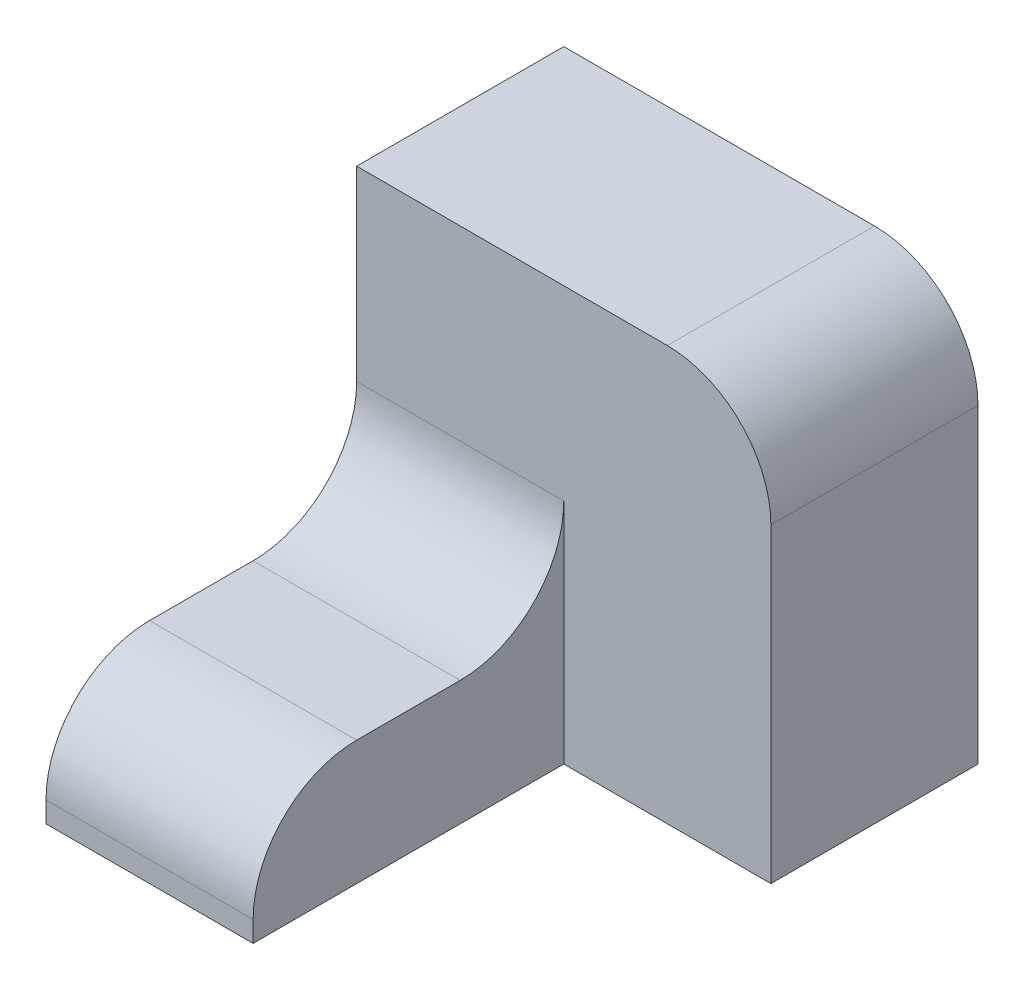
ISO-10303-21;
HEADER;
FILE_DESCRIPTION(('STEP AP214'),'2;1');
FILE_NAME('part.step','',(''),(''),'','','');
FILE_SCHEMA(('AUTOMOTIVE_DESIGN { 1 0 10303 214 1 1 1 1 }'));
ENDSEC;
DATA;
#1=APPLICATION_CONTEXT('core data for automotive mechanical design processes');
#2=APPLICATION_PROTOCOL_DEFINITION('international standard','automotive_design',2000,#1);
#3=PRODUCT_CONTEXT('',#1,'mechanical');
#4=PRODUCT('Part','Part','',(#3));
#5=PRODUCT_RELATED_PRODUCT_CATEGORY('part','',(#4));
#6=PRODUCT_DEFINITION_FORMATION('','',#4);
#7=PRODUCT_DEFINITION_CONTEXT('part definition',#1,'design');
#8=PRODUCT_DEFINITION('design','',#6,#7);
#9=PRODUCT_DEFINITION_SHAPE('','',#8);
#10=(LENGTH_UNIT() NAMED_UNIT(*) SI_UNIT(.MILLI.,.METRE.));
#11=(NAMED_UNIT(*) PLANE_ANGLE_UNIT() SI_UNIT($,.RADIAN.));
#12=(NAMED_UNIT(*) SI_UNIT($,.STERADIAN.) SOLID_ANGLE_UNIT());
#13=UNCERTAINTY_MEASURE_WITH_UNIT(LENGTH_MEASURE(1.E-05),#10,'distance_accuracy_value','');
#14=(GEOMETRIC_REPRESENTATION_CONTEXT(3) GLOBAL_UNCERTAINTY_ASSIGNED_CONTEXT((#13)) GLOBAL_UNIT_ASSIGNED_CONTEXT((#10,
#11,#12)) REPRESENTATION_CONTEXT('',''));
#15=CARTESIAN_POINT('',(0.,0.,0.));
#16=DIRECTION('',(0.,0.,1.));
#17=DIRECTION('',(1.,0.,0.));
#18=AXIS2_PLACEMENT_3D('',#15,#16,#17);
#19=CARTESIAN_POINT('',(-10.,0.,30.));
#20=DIRECTION('',(0.,-1.,0.));
#21=DIRECTION('',(1.,0.,0.));
#22=AXIS2_PLACEMENT_3D('',#19,#20,#21);
#23=PLANE('',#22);
#24=DIRECTION('',(0.,0.,-1.));
#25=VECTOR('',#24,1.);
#26=CARTESIAN_POINT('',(-10.,0.,30.));
#27=LINE('',#26,#25);
#28=CARTESIAN_POINT('',(-10.,0.,20.));
#29=VERTEX_POINT('',#28);
#30=CARTESIAN_POINT('',(-10.,0.,10.));
#31=VERTEX_POINT('',#30);
#32=EDGE_CURVE('E164',#29,#31,#27,.T.);
#33=ORIENTED_EDGE('',*,*,#32,.T.);
#34=DIRECTION('',(-1.,0.,0.));
#35=VECTOR('',#34,1.);
#36=CARTESIAN_POINT('',(-10.,0.,10.));
#37=LINE('',#36,#35);
#38=CARTESIAN_POINT('',(-30.,0.,10.));
#39=VERTEX_POINT('',#38);
#40=EDGE_CURVE('E178',#31,#39,#37,.T.);
#41=ORIENTED_EDGE('',*,*,#40,.T.);
#42=DIRECTION('',(0.,0.,-1.));
#43=VECTOR('',#42,1.);
#44=CARTESIAN_POINT('',(-30.,0.,30.));
#45=LINE('',#44,#43);
#46=CARTESIAN_POINT('',(-30.,0.,20.));
#47=VERTEX_POINT('',#46);
#48=EDGE_CURVE('E173',#47,#39,#45,.T.);
#49=ORIENTED_EDGE('',*,*,#48,.F.);
#50=DIRECTION('',(-1.,0.,0.));
#51=VECTOR('',#50,1.);
#52=CARTESIAN_POINT('',(-10.,0.,20.));
#53=LINE('',#52,#51);
#54=EDGE_CURVE('E176',#47,#29,#53,.F.);
#55=ORIENTED_EDGE('',*,*,#54,.T.);
#56=EDGE_LOOP('',(#33,#41,#49,#55));
#57=FACE_BOUND('',#56,.T.);
#58=ADVANCED_FACE('F35',(#57),#23,.F.);
#59=CARTESIAN_POINT('',(-30.,0.,30.));
#60=DIRECTION('',(1.,0.,0.));
#61=DIRECTION('',(0.,0.,-1.));
#62=AXIS2_PLACEMENT_3D('',#59,#60,#61);
#63=PLANE('',#62);
#64=DIRECTION('',(0.,-1.,0.));
#65=VECTOR('',#64,1.);
#66=CARTESIAN_POINT('',(-30.,0.,30.));
#67=LINE('',#66,#65);
#68=CARTESIAN_POINT('',(-30.,-10.,30.));
#69=VERTEX_POINT('',#68);
#70=CARTESIAN_POINT('',(-30.,-12.,30.));
#71=VERTEX_POINT('',#70);
#72=EDGE_CURVE('E158',#69,#71,#67,.T.);
#73=ORIENTED_EDGE('',*,*,#72,.F.);
#74=CARTESIAN_POINT('',(-30.,-10.,20.));
#75=DIRECTION('',(1.,0.,0.));
#76=DIRECTION('',(0.,0.,-1.));
#77=AXIS2_PLACEMENT_3D('',#74,#75,#76);
#78=CIRCLE('',#77,10.);
#79=EDGE_CURVE('E58',#69,#47,#78,.F.);
#80=ORIENTED_EDGE('',*,*,#79,.T.);
#81=ORIENTED_EDGE('',*,*,#48,.T.);
#82=CARTESIAN_POINT('',(-30.,10.,10.));
#83=DIRECTION('',(1.,0.,0.));
#84=DIRECTION('',(0.,0.,-1.));
#85=AXIS2_PLACEMENT_3D('',#82,#83,#84);
#86=CIRCLE('',#85,10.);
#87=CARTESIAN_POINT('',(-30.,10.,0.));
#88=VERTEX_POINT('',#87);
#89=EDGE_CURVE('E43',#39,#88,#86,.T.);
#90=ORIENTED_EDGE('',*,*,#89,.T.);
#91=DIRECTION('',(0.,-1.,0.));
#92=VECTOR('',#91,1.);
#93=CARTESIAN_POINT('',(-30.,28.,0.));
#94=LINE('',#93,#92);
#95=CARTESIAN_POINT('',(-30.,28.,0.));
#96=VERTEX_POINT('',#95);
#97=EDGE_CURVE('E134',#96,#88,#94,.T.);
#98=ORIENTED_EDGE('',*,*,#97,.F.);
#99=DIRECTION('',(0.,0.,1.));
#100=VECTOR('',#99,1.);
#101=CARTESIAN_POINT('',(-30.,28.,-20.));
#102=LINE('',#101,#100);
#103=CARTESIAN_POINT('',(-30.,28.,-20.));
#104=VERTEX_POINT('',#103);
#105=EDGE_CURVE('E118',#104,#96,#102,.T.);
#106=ORIENTED_EDGE('',*,*,#105,.F.);
#107=DIRECTION('',(0.,-1.,0.));
#108=VECTOR('',#107,1.);
#109=CARTESIAN_POINT('',(-30.,28.,-20.));
#110=LINE('',#109,#108);
#111=CARTESIAN_POINT('',(-30.,-12.,-20.));
#112=VERTEX_POINT('',#111);
#113=EDGE_CURVE('E125',#104,#112,#110,.T.);
#114=ORIENTED_EDGE('',*,*,#113,.T.);
#115=DIRECTION('',(0.,0.,-1.));
#116=VECTOR('',#115,1.);
#117=CARTESIAN_POINT('',(-30.,-12.,30.));
#118=LINE('',#117,#116);
#119=EDGE_CURVE('E171',#71,#112,#118,.T.);
#120=ORIENTED_EDGE('',*,*,#119,.F.);
#121=EDGE_LOOP('',(#73,#80,#81,#90,#98,#106,#114,#120));
#122=FACE_BOUND('',#121,.T.);
#123=ADVANCED_FACE('F131',(#122),#63,.F.);
#124=CARTESIAN_POINT('',(-30.,-12.,30.));
#125=DIRECTION('',(0.,1.,0.));
#126=DIRECTION('',(0.,0.,1.));
#127=AXIS2_PLACEMENT_3D('',#124,#125,#126);
#128=PLANE('',#127);
#129=ORIENTED_EDGE('',*,*,#119,.T.);
#130=DIRECTION('',(1.,0.,0.));
#131=VECTOR('',#130,1.);
#132=CARTESIAN_POINT('',(-30.,-12.,-20.));
#133=LINE('',#132,#131);
#134=CARTESIAN_POINT('',(10.,-12.,-20.));
#135=VERTEX_POINT('',#134);
#136=EDGE_CURVE('E142',#112,#135,#133,.T.);
#137=ORIENTED_EDGE('',*,*,#136,.T.);
#138=DIRECTION('',(0.,0.,1.));
#139=VECTOR('',#138,1.);
#140=CARTESIAN_POINT('',(10.,-12.,-20.));
#141=LINE('',#140,#139);
#142=CARTESIAN_POINT('',(10.,-12.,0.));
#143=VERTEX_POINT('',#142);
#144=EDGE_CURVE('E135',#135,#143,#141,.T.);
#145=ORIENTED_EDGE('',*,*,#144,.T.);
#146=DIRECTION('',(1.,0.,0.));
#147=VECTOR('',#146,1.);
#148=CARTESIAN_POINT('',(-30.,-12.,0.));
#149=LINE('',#148,#147);
#150=CARTESIAN_POINT('',(-10.,-12.,0.));
#151=VERTEX_POINT('',#150);
#152=EDGE_CURVE('E151',#151,#143,#149,.T.);
#153=ORIENTED_EDGE('',*,*,#152,.F.);
#154=DIRECTION('',(0.,0.,-1.));
#155=VECTOR('',#154,1.);
#156=CARTESIAN_POINT('',(-10.,-12.,30.));
#157=LINE('',#156,#155);
#158=CARTESIAN_POINT('',(-10.,-12.,30.));
#159=VERTEX_POINT('',#158);
#160=EDGE_CURVE('E168',#159,#151,#157,.T.);
#161=ORIENTED_EDGE('',*,*,#160,.F.);
#162=DIRECTION('',(1.,0.,0.));
#163=VECTOR('',#162,1.);
#164=CARTESIAN_POINT('',(-30.,-12.,30.));
#165=LINE('',#164,#163);
#166=EDGE_CURVE('E160',#71,#159,#165,.T.);
#167=ORIENTED_EDGE('',*,*,#166,.F.);
#168=EDGE_LOOP('',(#129,#137,#145,#153,#161,#167));
#169=FACE_BOUND('',#168,.T.);
#170=ADVANCED_FACE('F210',(#169),#128,.F.);
#171=CARTESIAN_POINT('',(-10.,-12.,30.));
#172=DIRECTION('',(-1.,0.,0.));
#173=DIRECTION('',(0.,0.,1.));
#174=AXIS2_PLACEMENT_3D('',#171,#172,#173);
#175=PLANE('',#174);
#176=ORIENTED_EDGE('',*,*,#32,.F.);
#177=CARTESIAN_POINT('',(-10.,-10.,20.));
#178=DIRECTION('',(-1.,0.,0.));
#179=DIRECTION('',(0.,0.,1.));
#180=AXIS2_PLACEMENT_3D('',#177,#178,#179);
#181=CIRCLE('',#180,10.);
#182=CARTESIAN_POINT('',(-10.,-10.,30.));
#183=VERTEX_POINT('',#182);
#184=EDGE_CURVE('E50',#29,#183,#181,.F.);
#185=ORIENTED_EDGE('',*,*,#184,.T.);
#186=DIRECTION('',(0.,1.,0.));
#187=VECTOR('',#186,1.);
#188=CARTESIAN_POINT('',(-10.,-12.,30.));
#189=LINE('',#188,#187);
#190=EDGE_CURVE('E162',#159,#183,#189,.T.);
#191=ORIENTED_EDGE('',*,*,#190,.F.);
#192=ORIENTED_EDGE('',*,*,#160,.T.);
#193=DIRECTION('',(0.,1.,0.));
#194=VECTOR('',#193,1.);
#195=CARTESIAN_POINT('',(-10.,-12.,0.));
#196=LINE('',#195,#194);
#197=CARTESIAN_POINT('',(-10.,10.,0.));
#198=VERTEX_POINT('',#197);
#199=EDGE_CURVE('E156',#151,#198,#196,.T.);
#200=ORIENTED_EDGE('',*,*,#199,.T.);
#201=CARTESIAN_POINT('',(-10.,10.,10.));
#202=DIRECTION('',(-1.,0.,0.));
#203=DIRECTION('',(0.,0.,1.));
#204=AXIS2_PLACEMENT_3D('',#201,#202,#203);
#205=CIRCLE('',#204,10.);
#206=EDGE_CURVE('E11',#198,#31,#205,.T.);
#207=ORIENTED_EDGE('',*,*,#206,.T.);
#208=EDGE_LOOP('',(#176,#185,#191,#192,#200,#207));
#209=FACE_BOUND('',#208,.T.);
#210=ADVANCED_FACE('F203',(#209),#175,.F.);
#211=CARTESIAN_POINT('',(0.,0.,30.));
#212=DIRECTION('',(0.,0.,1.));
#213=DIRECTION('',(1.,0.,0.));
#214=AXIS2_PLACEMENT_3D('',#211,#212,#213);
#215=PLANE('',#214);
#216=ORIENTED_EDGE('',*,*,#190,.T.);
#217=DIRECTION('',(-1.,0.,0.));
#218=VECTOR('',#217,1.);
#219=CARTESIAN_POINT('',(-30.,-10.,30.));
#220=LINE('',#219,#218);
#221=EDGE_CURVE('E192',#183,#69,#220,.T.);
#222=ORIENTED_EDGE('',*,*,#221,.T.);
#223=ORIENTED_EDGE('',*,*,#72,.T.);
#224=ORIENTED_EDGE('',*,*,#166,.T.);
#225=EDGE_LOOP('',(#216,#222,#223,#224));
#226=FACE_BOUND('',#225,.T.);
#227=ADVANCED_FACE('F206',(#226),#215,.T.);
#228=CARTESIAN_POINT('',(0.,0.,0.));
#229=DIRECTION('',(0.,0.,1.));
#230=DIRECTION('',(1.,0.,0.));
#231=AXIS2_PLACEMENT_3D('',#228,#229,#230);
#232=PLANE('',#231);
#233=ORIENTED_EDGE('',*,*,#97,.T.);
#234=DIRECTION('',(-1.,0.,0.));
#235=VECTOR('',#234,1.);
#236=CARTESIAN_POINT('',(0.,10.,0.));
#237=LINE('',#236,#235);
#238=EDGE_CURVE('E183',#88,#198,#237,.F.);
#239=ORIENTED_EDGE('',*,*,#238,.T.);
#240=ORIENTED_EDGE('',*,*,#199,.F.);
#241=ORIENTED_EDGE('',*,*,#152,.T.);
#242=DIRECTION('',(0.,1.,0.));
#243=VECTOR('',#242,1.);
#244=CARTESIAN_POINT('',(10.,-12.,0.));
#245=LINE('',#244,#243);
#246=CARTESIAN_POINT('',(10.,18.,0.));
#247=VERTEX_POINT('',#246);
#248=EDGE_CURVE('E126',#143,#247,#245,.T.);
#249=ORIENTED_EDGE('',*,*,#248,.T.);
#250=CARTESIAN_POINT('',(0.,18.,0.));
#251=DIRECTION('',(0.,0.,1.));
#252=DIRECTION('',(1.,0.,0.));
#253=AXIS2_PLACEMENT_3D('',#250,#251,#252);
#254=CIRCLE('',#253,10.);
#255=CARTESIAN_POINT('',(0.,28.,0.));
#256=VERTEX_POINT('',#255);
#257=EDGE_CURVE('E181',#247,#256,#254,.T.);
#258=ORIENTED_EDGE('',*,*,#257,.T.);
#259=DIRECTION('',(-1.,0.,0.));
#260=VECTOR('',#259,1.);
#261=CARTESIAN_POINT('',(10.,28.,0.));
#262=LINE('',#261,#260);
#263=EDGE_CURVE('E148',#256,#96,#262,.T.);
#264=ORIENTED_EDGE('',*,*,#263,.T.);
#265=EDGE_LOOP('',(#233,#239,#240,#241,#249,#258,#264));
#266=FACE_BOUND('',#265,.T.);
#267=ADVANCED_FACE('F200',(#266),#232,.T.);
#268=CARTESIAN_POINT('',(10.,28.,-20.));
#269=DIRECTION('',(0.,1.,0.));
#270=DIRECTION('',(-1.,0.,0.));
#271=AXIS2_PLACEMENT_3D('',#268,#269,#270);
#272=PLANE('',#271);
#273=ORIENTED_EDGE('',*,*,#263,.F.);
#274=DIRECTION('',(0.,0.,1.));
#275=VECTOR('',#274,1.);
#276=CARTESIAN_POINT('',(0.,28.,-20.));
#277=LINE('',#276,#275);
#278=CARTESIAN_POINT('',(0.,28.,-20.));
#279=VERTEX_POINT('',#278);
#280=EDGE_CURVE('E121',#256,#279,#277,.F.);
#281=ORIENTED_EDGE('',*,*,#280,.T.);
#282=DIRECTION('',(-1.,0.,0.));
#283=VECTOR('',#282,1.);
#284=CARTESIAN_POINT('',(10.,28.,-20.));
#285=LINE('',#284,#283);
#286=EDGE_CURVE('E114',#279,#104,#285,.T.);
#287=ORIENTED_EDGE('',*,*,#286,.T.);
#288=ORIENTED_EDGE('',*,*,#105,.T.);
#289=EDGE_LOOP('',(#273,#281,#287,#288));
#290=FACE_BOUND('',#289,.T.);
#291=ADVANCED_FACE('F117',(#290),#272,.T.);
#292=CARTESIAN_POINT('',(10.,-12.,-20.));
#293=DIRECTION('',(1.,0.,0.));
#294=DIRECTION('',(0.,0.,-1.));
#295=AXIS2_PLACEMENT_3D('',#292,#293,#294);
#296=PLANE('',#295);
#297=DIRECTION('',(0.,1.,0.));
#298=VECTOR('',#297,1.);
#299=CARTESIAN_POINT('',(10.,-12.,-20.));
#300=LINE('',#299,#298);
#301=CARTESIAN_POINT('',(10.,18.,-20.));
#302=VERTEX_POINT('',#301);
#303=EDGE_CURVE('E136',#135,#302,#300,.T.);
#304=ORIENTED_EDGE('',*,*,#303,.T.);
#305=DIRECTION('',(0.,0.,1.));
#306=VECTOR('',#305,1.);
#307=CARTESIAN_POINT('',(10.,18.,-20.));
#308=LINE('',#307,#306);
#309=EDGE_CURVE('E186',#302,#247,#308,.T.);
#310=ORIENTED_EDGE('',*,*,#309,.T.);
#311=ORIENTED_EDGE('',*,*,#248,.F.);
#312=ORIENTED_EDGE('',*,*,#144,.F.);
#313=EDGE_LOOP('',(#304,#310,#311,#312));
#314=FACE_BOUND('',#313,.T.);
#315=ADVANCED_FACE('F214',(#314),#296,.T.);
#316=CARTESIAN_POINT('',(0.,0.,-20.));
#317=DIRECTION('',(0.,0.,1.));
#318=DIRECTION('',(1.,0.,0.));
#319=AXIS2_PLACEMENT_3D('',#316,#317,#318);
#320=PLANE('',#319);
#321=ORIENTED_EDGE('',*,*,#286,.F.);
#322=CARTESIAN_POINT('',(0.,18.,-20.));
#323=DIRECTION('',(0.,0.,1.));
#324=DIRECTION('',(1.,0.,0.));
#325=AXIS2_PLACEMENT_3D('',#322,#323,#324);
#326=CIRCLE('',#325,10.);
#327=EDGE_CURVE('E190',#279,#302,#326,.F.);
#328=ORIENTED_EDGE('',*,*,#327,.T.);
#329=ORIENTED_EDGE('',*,*,#303,.F.);
#330=ORIENTED_EDGE('',*,*,#136,.F.);
#331=ORIENTED_EDGE('',*,*,#113,.F.);
#332=EDGE_LOOP('',(#321,#328,#329,#330,#331));
#333=FACE_BOUND('',#332,.T.);
#334=ADVANCED_FACE('F139',(#333),#320,.F.);
#335=CARTESIAN_POINT('',(-10.,10.,10.));
#336=DIRECTION('',(-1.,0.,0.));
#337=DIRECTION('',(0.,-1.,0.));
#338=AXIS2_PLACEMENT_3D('',#335,#336,#337);
#339=CYLINDRICAL_SURFACE('',#338,10.);
#340=ORIENTED_EDGE('',*,*,#206,.F.);
#341=ORIENTED_EDGE('',*,*,#238,.F.);
#342=ORIENTED_EDGE('',*,*,#89,.F.);
#343=ORIENTED_EDGE('',*,*,#40,.F.);
#344=EDGE_LOOP('',(#340,#341,#342,#343));
#345=FACE_BOUND('',#344,.T.);
#346=ADVANCED_FACE('F202',(#345),#339,.F.);
#347=CARTESIAN_POINT('',(0.,18.,-20.));
#348=DIRECTION('',(0.,0.,1.));
#349=DIRECTION('',(1.,0.,0.));
#350=AXIS2_PLACEMENT_3D('',#347,#348,#349);
#351=CYLINDRICAL_SURFACE('',#350,10.);
#352=ORIENTED_EDGE('',*,*,#327,.F.);
#353=ORIENTED_EDGE('',*,*,#280,.F.);
#354=ORIENTED_EDGE('',*,*,#257,.F.);
#355=ORIENTED_EDGE('',*,*,#309,.F.);
#356=EDGE_LOOP('',(#352,#353,#354,#355));
#357=FACE_BOUND('',#356,.T.);
#358=ADVANCED_FACE('F217',(#357),#351,.T.);
#359=CARTESIAN_POINT('',(0.,-10.,20.));
#360=DIRECTION('',(1.,0.,0.));
#361=DIRECTION('',(0.,1.,0.));
#362=AXIS2_PLACEMENT_3D('',#359,#360,#361);
#363=CYLINDRICAL_SURFACE('',#362,10.);
#364=ORIENTED_EDGE('',*,*,#184,.F.);
#365=ORIENTED_EDGE('',*,*,#54,.F.);
#366=ORIENTED_EDGE('',*,*,#79,.F.);
#367=ORIENTED_EDGE('',*,*,#221,.F.);
#368=EDGE_LOOP('',(#364,#365,#366,#367));
#369=FACE_BOUND('',#368,.T.);
#370=ADVANCED_FACE('F37',(#369),#363,.T.);
#371=CLOSED_SHELL('',(#58,#123,#170,#210,#227,#267,#291,#315,#334,#346,#358,#370));
#372=MANIFOLD_SOLID_BREP('B2',#371);
#373=ADVANCED_BREP_SHAPE_REPRESENTATION('',(#18,#372),#14);
#374=SHAPE_DEFINITION_REPRESENTATION(#9,#373);
ENDSEC;
END-ISO-10303-21;
